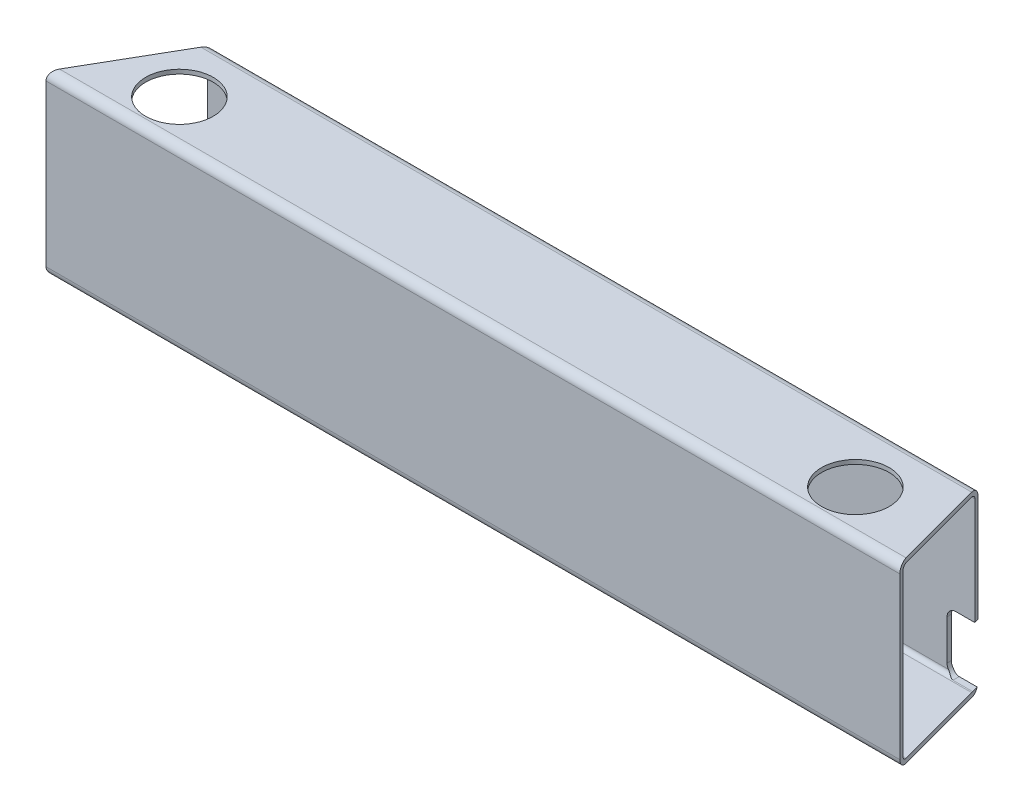
ISO-10303-21;
HEADER;
FILE_DESCRIPTION(('STEP AP214'),'2;1');
FILE_NAME('part.step','',(''),(''),'','','');
FILE_SCHEMA(('AUTOMOTIVE_DESIGN { 1 0 10303 214 1 1 1 1 }'));
ENDSEC;
DATA;
#1=APPLICATION_CONTEXT('core data for automotive mechanical design processes');
#2=APPLICATION_PROTOCOL_DEFINITION('international standard','automotive_design',2000,#1);
#3=PRODUCT_CONTEXT('',#1,'mechanical');
#4=PRODUCT('Part','Part','',(#3));
#5=PRODUCT_RELATED_PRODUCT_CATEGORY('part','',(#4));
#6=PRODUCT_DEFINITION_FORMATION('','',#4);
#7=PRODUCT_DEFINITION_CONTEXT('part definition',#1,'design');
#8=PRODUCT_DEFINITION('design','',#6,#7);
#9=PRODUCT_DEFINITION_SHAPE('','',#8);
#10=(LENGTH_UNIT() NAMED_UNIT(*) SI_UNIT(.MILLI.,.METRE.));
#11=(NAMED_UNIT(*) PLANE_ANGLE_UNIT() SI_UNIT($,.RADIAN.));
#12=(NAMED_UNIT(*) SI_UNIT($,.STERADIAN.) SOLID_ANGLE_UNIT());
#13=UNCERTAINTY_MEASURE_WITH_UNIT(LENGTH_MEASURE(1.E-05),#10,'distance_accuracy_value','');
#14=(GEOMETRIC_REPRESENTATION_CONTEXT(3) GLOBAL_UNCERTAINTY_ASSIGNED_CONTEXT((#13)) GLOBAL_UNIT_ASSIGNED_CONTEXT((#10,
#11,#12)) REPRESENTATION_CONTEXT('',''));
#15=CARTESIAN_POINT('',(0.,0.,0.));
#16=DIRECTION('',(0.,0.,1.));
#17=DIRECTION('',(1.,0.,0.));
#18=AXIS2_PLACEMENT_3D('',#15,#16,#17);
#19=CARTESIAN_POINT('',(63.5,0.,-31.75));
#20=DIRECTION('',(0.,1.,0.));
#21=DIRECTION('',(0.,0.,1.));
#22=AXIS2_PLACEMENT_3D('',#19,#20,#21);
#23=CYLINDRICAL_SURFACE('',#22,24.13);
#24=CARTESIAN_POINT('',(63.5,-123.952,-31.75));
#25=DIRECTION('',(0.,1.,0.));
#26=DIRECTION('',(0.,0.,1.));
#27=AXIS2_PLACEMENT_3D('',#24,#25,#26);
#28=CIRCLE('',#27,24.13);
#29=CARTESIAN_POINT('',(63.5,-123.952,-7.62));
#30=VERTEX_POINT('',#29);
#31=EDGE_CURVE('E265',#30,#30,#28,.F.);
#32=ORIENTED_EDGE('',*,*,#31,.F.);
#33=EDGE_LOOP('',(#32));
#34=FACE_BOUND('',#33,.T.);
#35=CARTESIAN_POINT('',(63.5,-127.,-31.75));
#36=DIRECTION('',(0.,1.,0.));
#37=DIRECTION('',(0.,0.,1.));
#38=AXIS2_PLACEMENT_3D('',#35,#36,#37);
#39=CIRCLE('',#38,24.13);
#40=CARTESIAN_POINT('',(63.5,-127.,-7.62));
#41=VERTEX_POINT('',#40);
#42=EDGE_CURVE('E20',#41,#41,#39,.T.);
#43=ORIENTED_EDGE('',*,*,#42,.F.);
#44=EDGE_LOOP('',(#43));
#45=FACE_BOUND('',#44,.T.);
#46=ADVANCED_FACE('F17',(#34,#45),#23,.F.);
#47=CARTESIAN_POINT('',(546.1,0.,-31.75));
#48=DIRECTION('',(0.,1.,0.));
#49=DIRECTION('',(0.,0.,1.));
#50=AXIS2_PLACEMENT_3D('',#47,#48,#49);
#51=CYLINDRICAL_SURFACE('',#50,24.13);
#52=CARTESIAN_POINT('',(546.1,-123.952,-31.75));
#53=DIRECTION('',(0.,1.,0.));
#54=DIRECTION('',(0.,0.,1.));
#55=AXIS2_PLACEMENT_3D('',#52,#53,#54);
#56=CIRCLE('',#55,24.13);
#57=CARTESIAN_POINT('',(546.1,-123.952,-7.62));
#58=VERTEX_POINT('',#57);
#59=EDGE_CURVE('E374',#58,#58,#56,.F.);
#60=ORIENTED_EDGE('',*,*,#59,.F.);
#61=EDGE_LOOP('',(#60));
#62=FACE_BOUND('',#61,.T.);
#63=CARTESIAN_POINT('',(546.1,-127.,-31.75));
#64=DIRECTION('',(0.,1.,0.));
#65=DIRECTION('',(0.,0.,1.));
#66=AXIS2_PLACEMENT_3D('',#63,#64,#65);
#67=CIRCLE('',#66,24.13);
#68=CARTESIAN_POINT('',(546.1,-127.,-7.62));
#69=VERTEX_POINT('',#68);
#70=EDGE_CURVE('E168',#69,#69,#67,.T.);
#71=ORIENTED_EDGE('',*,*,#70,.F.);
#72=EDGE_LOOP('',(#71));
#73=FACE_BOUND('',#72,.T.);
#74=ADVANCED_FACE('F571',(#62,#73),#51,.F.);
#75=CARTESIAN_POINT('',(63.5,0.,-31.75));
#76=DIRECTION('',(0.,1.,0.));
#77=DIRECTION('',(0.,0.,1.));
#78=AXIS2_PLACEMENT_3D('',#75,#76,#77);
#79=CYLINDRICAL_SURFACE('',#78,24.13);
#80=CARTESIAN_POINT('',(63.5,-3.048,-31.75));
#81=DIRECTION('',(0.,1.,0.));
#82=DIRECTION('',(0.,0.,1.));
#83=AXIS2_PLACEMENT_3D('',#80,#81,#82);
#84=CIRCLE('',#83,24.13);
#85=CARTESIAN_POINT('',(63.5,-3.048,-7.62));
#86=VERTEX_POINT('',#85);
#87=EDGE_CURVE('E371',#86,#86,#84,.T.);
#88=ORIENTED_EDGE('',*,*,#87,.F.);
#89=EDGE_LOOP('',(#88));
#90=FACE_BOUND('',#89,.T.);
#91=CARTESIAN_POINT('',(63.5,0.,-31.75));
#92=DIRECTION('',(0.,1.,0.));
#93=DIRECTION('',(0.,0.,1.));
#94=AXIS2_PLACEMENT_3D('',#91,#92,#93);
#95=CIRCLE('',#94,24.13);
#96=CARTESIAN_POINT('',(63.5,0.,-7.62));
#97=VERTEX_POINT('',#96);
#98=EDGE_CURVE('E270',#97,#97,#95,.F.);
#99=ORIENTED_EDGE('',*,*,#98,.F.);
#100=EDGE_LOOP('',(#99));
#101=FACE_BOUND('',#100,.T.);
#102=ADVANCED_FACE('F561',(#90,#101),#79,.F.);
#103=CARTESIAN_POINT('',(546.1,0.,-31.75));
#104=DIRECTION('',(0.,1.,0.));
#105=DIRECTION('',(0.,0.,1.));
#106=AXIS2_PLACEMENT_3D('',#103,#104,#105);
#107=CYLINDRICAL_SURFACE('',#106,24.13);
#108=CARTESIAN_POINT('',(546.1,-3.048,-31.75));
#109=DIRECTION('',(0.,1.,0.));
#110=DIRECTION('',(0.,0.,1.));
#111=AXIS2_PLACEMENT_3D('',#108,#109,#110);
#112=CIRCLE('',#111,24.13);
#113=CARTESIAN_POINT('',(546.1,-3.048,-7.62));
#114=VERTEX_POINT('',#113);
#115=EDGE_CURVE('E367',#114,#114,#112,.T.);
#116=ORIENTED_EDGE('',*,*,#115,.F.);
#117=EDGE_LOOP('',(#116));
#118=FACE_BOUND('',#117,.T.);
#119=CARTESIAN_POINT('',(546.1,0.,-31.75));
#120=DIRECTION('',(0.,1.,0.));
#121=DIRECTION('',(0.,0.,1.));
#122=AXIS2_PLACEMENT_3D('',#119,#120,#121);
#123=CIRCLE('',#122,24.13);
#124=CARTESIAN_POINT('',(546.1,0.,-7.62));
#125=VERTEX_POINT('',#124);
#126=EDGE_CURVE('E267',#125,#125,#123,.F.);
#127=ORIENTED_EDGE('',*,*,#126,.F.);
#128=EDGE_LOOP('',(#127));
#129=FACE_BOUND('',#128,.T.);
#130=ADVANCED_FACE('F552',(#118,#129),#107,.F.);
#131=CARTESIAN_POINT('',(570.132271536834,-117.475,-76.2));
#132=DIRECTION('',(-1.,0.,0.));
#133=DIRECTION('',(0.,0.,1.));
#134=AXIS2_PLACEMENT_3D('',#131,#132,#133);
#135=PLANE('',#134);
#136=DIRECTION('',(0.,1.,0.));
#137=VECTOR('',#136,1.);
#138=CARTESIAN_POINT('',(570.132271536834,-6.096,-73.152));
#139=LINE('',#138,#137);
#140=CARTESIAN_POINT('',(570.132271536834,-117.475,-73.152));
#141=VERTEX_POINT('',#140);
#142=CARTESIAN_POINT('',(570.132271536834,-88.9,-73.152));
#143=VERTEX_POINT('',#142);
#144=EDGE_CURVE('E366',#141,#143,#139,.T.);
#145=ORIENTED_EDGE('',*,*,#144,.F.);
#146=DIRECTION('',(0.,0.,-1.));
#147=VECTOR('',#146,1.);
#148=CARTESIAN_POINT('',(570.132271536834,-117.475,-76.2));
#149=LINE('',#148,#147);
#150=CARTESIAN_POINT('',(570.132271536834,-117.475,-76.2));
#151=VERTEX_POINT('',#150);
#152=EDGE_CURVE('E150',#141,#151,#149,.T.);
#153=ORIENTED_EDGE('',*,*,#152,.T.);
#154=DIRECTION('',(0.,1.,0.));
#155=VECTOR('',#154,1.);
#156=CARTESIAN_POINT('',(570.132271536834,-120.904,-76.2));
#157=LINE('',#156,#155);
#158=CARTESIAN_POINT('',(570.132271536834,-88.9,-76.2));
#159=VERTEX_POINT('',#158);
#160=EDGE_CURVE('E275',#159,#151,#157,.F.);
#161=ORIENTED_EDGE('',*,*,#160,.F.);
#162=DIRECTION('',(0.,0.,-1.));
#163=VECTOR('',#162,1.);
#164=CARTESIAN_POINT('',(570.132271536834,-88.9,-76.2));
#165=LINE('',#164,#163);
#166=EDGE_CURVE('E299',#159,#143,#165,.F.);
#167=ORIENTED_EDGE('',*,*,#166,.T.);
#168=EDGE_LOOP('',(#145,#153,#161,#167));
#169=FACE_BOUND('',#168,.T.);
#170=ADVANCED_FACE('F497',(#169),#135,.F.);
#171=CARTESIAN_POINT('',(576.482271536834,-88.9,-76.2));
#172=DIRECTION('',(0.,0.,-1.));
#173=DIRECTION('',(-1.,0.,0.));
#174=AXIS2_PLACEMENT_3D('',#171,#172,#173);
#175=CYLINDRICAL_SURFACE('',#174,6.35);
#176=CARTESIAN_POINT('',(576.482271536834,-88.9,-73.152));
#177=DIRECTION('',(0.,0.,-1.));
#178=DIRECTION('',(-1.,0.,0.));
#179=AXIS2_PLACEMENT_3D('',#176,#177,#178);
#180=CIRCLE('',#179,6.35);
#181=CARTESIAN_POINT('',(576.482271536834,-82.55,-73.152));
#182=VERTEX_POINT('',#181);
#183=EDGE_CURVE('E362',#143,#182,#180,.T.);
#184=ORIENTED_EDGE('',*,*,#183,.F.);
#185=ORIENTED_EDGE('',*,*,#166,.F.);
#186=CARTESIAN_POINT('',(576.482271536834,-88.9,-76.2));
#187=DIRECTION('',(0.,0.,-1.));
#188=DIRECTION('',(-1.,0.,0.));
#189=AXIS2_PLACEMENT_3D('',#186,#187,#188);
#190=CIRCLE('',#189,6.35);
#191=CARTESIAN_POINT('',(576.482271536834,-82.55,-76.2));
#192=VERTEX_POINT('',#191);
#193=EDGE_CURVE('E176',#192,#159,#190,.F.);
#194=ORIENTED_EDGE('',*,*,#193,.F.);
#195=DIRECTION('',(0.,0.,1.));
#196=VECTOR('',#195,1.);
#197=CARTESIAN_POINT('',(576.482271536834,-82.55,-76.2));
#198=LINE('',#197,#196);
#199=EDGE_CURVE('E149',#192,#182,#198,.T.);
#200=ORIENTED_EDGE('',*,*,#199,.T.);
#201=EDGE_LOOP('',(#184,#185,#194,#200));
#202=FACE_BOUND('',#201,.T.);
#203=ADVANCED_FACE('F199',(#202),#175,.F.);
#204=CARTESIAN_POINT('',(576.482271536834,-117.475,-76.2));
#205=DIRECTION('',(0.,0.,-1.));
#206=DIRECTION('',(-1.,0.,0.));
#207=AXIS2_PLACEMENT_3D('',#204,#205,#206);
#208=CYLINDRICAL_SURFACE('',#207,6.35);
#209=ORIENTED_EDGE('',*,*,#152,.F.);
#210=CARTESIAN_POINT('',(576.482271536834,-117.475,-73.152));
#211=DIRECTION('',(0.,0.,-1.));
#212=DIRECTION('',(-1.,0.,0.));
#213=AXIS2_PLACEMENT_3D('',#210,#211,#212);
#214=CIRCLE('',#213,6.35);
#215=CARTESIAN_POINT('',(571.13769868204,-120.903999999971,-73.152));
#216=VERTEX_POINT('',#215);
#217=EDGE_CURVE('E357',#216,#141,#214,.T.);
#218=ORIENTED_EDGE('',*,*,#217,.F.);
#219=CARTESIAN_POINT('',(571.137698682022,-120.903999999942,-73.152));
#220=CARTESIAN_POINT('',(571.208653888073,-121.014657092336,-73.1519958651403));
#221=CARTESIAN_POINT('',(571.283026270926,-121.12295772783,-73.145978259839));
#222=CARTESIAN_POINT('',(571.437581092071,-121.33382465817,-73.123399265219));
#223=CARTESIAN_POINT('',(571.517749917778,-121.436403446459,-73.1068619109767));
#224=CARTESIAN_POINT('',(571.682008220305,-121.633878408931,-73.0650179072658));
#225=CARTESIAN_POINT('',(571.766024265583,-121.728864207435,-73.0398414844985));
#226=CARTESIAN_POINT('',(571.938368942122,-121.912489223484,-72.9819379408593));
#227=CARTESIAN_POINT('',(572.026700427849,-122.001124141943,-72.9492057674007));
#228=CARTESIAN_POINT('',(572.231414776507,-122.194915113941,-72.8676366480196));
#229=CARTESIAN_POINT('',(572.348923299269,-122.298056286764,-72.8168383013525));
#230=CARTESIAN_POINT('',(572.588812327703,-122.493709927749,-72.7070205359819));
#231=CARTESIAN_POINT('',(572.711193854511,-122.586220152248,-72.6479993876496));
#232=CARTESIAN_POINT('',(572.961495947899,-122.761802691016,-72.522807859894));
#233=CARTESIAN_POINT('',(573.089464468219,-122.844752351779,-72.4565621296623));
#234=CARTESIAN_POINT('',(573.348962977242,-123.000192109509,-72.3191829844994));
#235=CARTESIAN_POINT('',(573.480491686998,-123.072685904891,-72.2480513110158));
#236=CARTESIAN_POINT('',(573.785324327221,-123.227044413727,-72.0814042138575));
#237=CARTESIAN_POINT('',(573.959717596788,-123.305564192278,-71.9847820397144));
#238=CARTESIAN_POINT('',(574.314253476113,-123.446492183462,-71.7893814923592));
#239=CARTESIAN_POINT('',(574.494407246292,-123.508866687309,-71.6905990675455));
#240=CARTESIAN_POINT('',(574.767732795365,-123.589869040889,-71.5460144516401));
#241=CARTESIAN_POINT('',(574.858426999393,-123.614588101186,-71.4988759713409));
#242=CARTESIAN_POINT('',(575.041725271297,-123.660163782859,-71.4065005027832));
#243=CARTESIAN_POINT('',(575.134328864399,-123.68102135183,-71.3612630501308));
#244=CARTESIAN_POINT('',(575.321618448017,-123.718755649125,-71.2743378244688));
#245=CARTESIAN_POINT('',(575.416296675764,-123.735645119006,-71.2326389723888));
#246=CARTESIAN_POINT('',(575.608577832337,-123.76535826243,-71.1550235058921));
#247=CARTESIAN_POINT('',(575.706176994021,-123.77818694514,-71.1190997947215));
#248=CARTESIAN_POINT('',(575.859700250299,-123.794641678185,-71.0708637573932));
#249=CARTESIAN_POINT('',(575.914412605435,-123.799800719976,-71.055239284402));
#250=CARTESIAN_POINT('',(576.024822343718,-123.808743558447,-71.0275679263626));
#251=CARTESIAN_POINT('',(576.08051901312,-123.812528311941,-71.0155185533119));
#252=CARTESIAN_POINT('',(576.193535398544,-123.81868715446,-70.9956391956563));
#253=CARTESIAN_POINT('',(576.250866870767,-123.821041562307,-70.9878682108877));
#254=CARTESIAN_POINT('',(576.366205634296,-123.824204177821,-70.9773392444036));
#255=CARTESIAN_POINT('',(576.424214488584,-123.825007476577,-70.9745971794587));
#256=CARTESIAN_POINT('',(576.482271536834,-123.825,-70.9746681342509));
#257=B_SPLINE_CURVE_WITH_KNOTS('',3,(#219,#220,#221,#222,#223,#224,#225,#226,#227,#228,#229,
#230,#231,#232,#233,#234,#235,#236,#237,#238,#239,#240,#241,#242,#243,#244,#245,#246,#247,#248,
#249,#250,#251,#252,#253,#254,#255,#256),.UNSPECIFIED.,.F.,.F.,(4,2,2,2,2,2,2,2,2,2,2,2,2,2,2,2,
2,2,4),(0.,0.393954233361409,0.787011593898648,1.17438683815423,1.56202187739938,
2.05449256514312,2.54706699868426,3.04538613255923,3.54352856804493,4.18560929528554,
4.82901996545668,5.14442158884071,5.45974571082867,5.77404305028703,6.08795116493568,
6.2592416152802,6.43041257915382,6.60388840317165,6.77791234510042),.UNSPECIFIED.);
#258=CARTESIAN_POINT('',(576.482271536834,-123.825,-70.9746681342508));
#259=VERTEX_POINT('',#258);
#260=EDGE_CURVE('E146',#216,#259,#257,.T.);
#261=ORIENTED_EDGE('',*,*,#260,.T.);
#262=DIRECTION('',(0.,0.,-1.));
#263=VECTOR('',#262,1.);
#264=CARTESIAN_POINT('',(576.482271536834,-123.825,-76.2));
#265=LINE('',#264,#263);
#266=CARTESIAN_POINT('',(576.482271536834,-123.825000000002,-75.4546051059658));
#267=VERTEX_POINT('',#266);
#268=EDGE_CURVE('E141',#259,#267,#265,.T.);
#269=ORIENTED_EDGE('',*,*,#268,.T.);
#270=CARTESIAN_POINT('',(571.137698681995,-120.90399999996,-76.199999999968));
#271=CARTESIAN_POINT('',(571.229548470559,-121.047218320689,-76.2000141654088));
#272=CARTESIAN_POINT('',(571.327147979681,-121.186623333409,-76.1949548697989));
#273=CARTESIAN_POINT('',(571.532774311161,-121.456661995913,-76.1763983930361));
#274=CARTESIAN_POINT('',(571.640787783037,-121.58730652135,-76.1629118968739));
#275=CARTESIAN_POINT('',(571.865859496941,-121.838435773336,-76.1292833197039));
#276=CARTESIAN_POINT('',(571.982871285211,-121.958966742242,-76.1091738663658));
#277=CARTESIAN_POINT('',(572.225572283501,-122.189985451436,-76.0639758122435));
#278=CARTESIAN_POINT('',(572.351264179746,-122.300470057959,-76.0388856655453));
#279=CARTESIAN_POINT('',(572.609966090187,-122.510411484481,-75.9855252384734));
#280=CARTESIAN_POINT('',(572.742941255954,-122.609914944599,-75.957269523341));
#281=CARTESIAN_POINT('',(573.015956786792,-122.798033213789,-75.8991311075693));
#282=CARTESIAN_POINT('',(573.155996724555,-122.886648680303,-75.8692485053227));
#283=CARTESIAN_POINT('',(573.586418437015,-123.135952850148,-75.7794622469485));
#284=CARTESIAN_POINT('',(573.886860020719,-123.279903186667,-75.7194756338277));
#285=CARTESIAN_POINT('',(574.349627762606,-123.458398652998,-75.6393762726864));
#286=CARTESIAN_POINT('',(574.504351787288,-123.511322015341,-75.6145172310321));
#287=CARTESIAN_POINT('',(574.817986132874,-123.605203440564,-75.5691112922593));
#288=CARTESIAN_POINT('',(574.976894268534,-123.646167619369,-75.5485621925556));
#289=CARTESIAN_POINT('',(575.297602492867,-123.715667495566,-75.5129984910171));
#290=CARTESIAN_POINT('',(575.459394736727,-123.744232747921,-75.4979707413877));
#291=CARTESIAN_POINT('',(575.785103786285,-123.788749680078,-75.4742960802758));
#292=CARTESIAN_POINT('',(575.949019144764,-123.804709535309,-75.4656450333261));
#293=CARTESIAN_POINT('',(576.174780796943,-123.817849647522,-75.4585033176622));
#294=CARTESIAN_POINT('',(576.236259239799,-123.82053131451,-75.4570425763327));
#295=CARTESIAN_POINT('',(576.359246450461,-123.824105797844,-75.455093597044));
#296=CARTESIAN_POINT('',(576.420755177753,-123.824999689763,-75.4546047743546));
#297=CARTESIAN_POINT('',(576.482271536834,-123.825,-75.454605105967));
#298=B_SPLINE_CURVE_WITH_KNOTS('',3,(#270,#271,#272,#273,#274,#275,#276,#277,#278,#279,#280,
#281,#282,#283,#284,#285,#286,#287,#288,#289,#290,#291,#292,#293,#294,#295,#296,#297),
.UNSPECIFIED.,.F.,.F.,(4,2,2,2,2,2,2,2,2,2,2,2,2,4),(0.,0.510056394583429,1.01946738859741,
1.52640542381374,2.03350104981312,2.53835249907291,3.04317344915919,4.05375545154912,
4.54956480614795,5.04512015785623,5.53948769343207,6.03353433527749,6.21817090721173,
6.40269636359293),.UNSPECIFIED.);
#299=CARTESIAN_POINT('',(571.13769868204,-120.903999999971,-76.2));
#300=VERTEX_POINT('',#299);
#301=EDGE_CURVE('E138',#300,#267,#298,.T.);
#302=ORIENTED_EDGE('',*,*,#301,.F.);
#303=CARTESIAN_POINT('',(576.482271536834,-117.475,-76.2));
#304=DIRECTION('',(0.,0.,-1.));
#305=DIRECTION('',(-1.,0.,0.));
#306=AXIS2_PLACEMENT_3D('',#303,#304,#305);
#307=CIRCLE('',#306,6.35);
#308=EDGE_CURVE('E273',#151,#300,#307,.F.);
#309=ORIENTED_EDGE('',*,*,#308,.F.);
#310=EDGE_LOOP('',(#209,#218,#261,#269,#302,#309));
#311=FACE_BOUND('',#310,.T.);
#312=ADVANCED_FACE('F144',(#311),#208,.F.);
#313=CARTESIAN_POINT('',(592.357271536834,-123.825,-76.2));
#314=DIRECTION('',(0.,-1.,0.));
#315=DIRECTION('',(0.,0.,-1.));
#316=AXIS2_PLACEMENT_3D('',#313,#314,#315);
#317=PLANE('',#316);
#318=DIRECTION('',(1.,0.,0.));
#319=VECTOR('',#318,1.);
#320=CARTESIAN_POINT('',(0.,-123.825,-70.9746681342508));
#321=LINE('',#320,#319);
#322=CARTESIAN_POINT('',(590.582394990446,-123.825,-70.9746681342508));
#323=VERTEX_POINT('',#322);
#324=EDGE_CURVE('E264',#259,#323,#321,.T.);
#325=ORIENTED_EDGE('',*,*,#324,.T.);
#326=DIRECTION('',(0.258819045102493,0.,0.965925826289076));
#327=VECTOR('',#326,1.);
#328=CARTESIAN_POINT('',(589.182271536834,-123.825,-76.2));
#329=LINE('',#328,#327);
#330=CARTESIAN_POINT('',(589.381999496733,-123.825000000002,-75.4546051059658));
#331=VERTEX_POINT('',#330);
#332=EDGE_CURVE('E156',#323,#331,#329,.F.);
#333=ORIENTED_EDGE('',*,*,#332,.T.);
#334=DIRECTION('',(1.,0.,0.));
#335=VECTOR('',#334,1.);
#336=CARTESIAN_POINT('',(0.,-123.825000000004,-75.4546051059646));
#337=LINE('',#336,#335);
#338=EDGE_CURVE('E153',#267,#331,#337,.T.);
#339=ORIENTED_EDGE('',*,*,#338,.F.);
#340=ORIENTED_EDGE('',*,*,#268,.F.);
#341=EDGE_LOOP('',(#325,#333,#339,#340));
#342=FACE_BOUND('',#341,.T.);
#343=ADVANCED_FACE('F154',(#342),#317,.F.);
#344=CARTESIAN_POINT('',(576.482271536834,-82.55,-76.2));
#345=DIRECTION('',(0.,1.,0.));
#346=DIRECTION('',(0.,0.,1.));
#347=AXIS2_PLACEMENT_3D('',#344,#345,#346);
#348=PLANE('',#347);
#349=DIRECTION('',(1.,0.,0.));
#350=VECTOR('',#349,1.);
#351=CARTESIAN_POINT('',(0.,-82.55,-73.152));
#352=LINE('',#351,#350);
#353=CARTESIAN_POINT('',(589.998980675347,-82.55,-73.1520000000073));
#354=VERTEX_POINT('',#353);
#355=EDGE_CURVE('E365',#182,#354,#352,.T.);
#356=ORIENTED_EDGE('',*,*,#355,.F.);
#357=ORIENTED_EDGE('',*,*,#199,.F.);
#358=DIRECTION('',(-1.,0.,0.));
#359=VECTOR('',#358,1.);
#360=CARTESIAN_POINT('',(0.,-82.55,-76.2));
#361=LINE('',#360,#359);
#362=CARTESIAN_POINT('',(589.182271536834,-82.55,-76.2));
#363=VERTEX_POINT('',#362);
#364=EDGE_CURVE('E283',#363,#192,#361,.T.);
#365=ORIENTED_EDGE('',*,*,#364,.F.);
#366=DIRECTION('',(0.258819045102493,0.,0.965925826289076));
#367=VECTOR('',#366,1.);
#368=CARTESIAN_POINT('',(589.182271536834,-82.55,-76.2));
#369=LINE('',#368,#367);
#370=EDGE_CURVE('E291',#363,#354,#369,.T.);
#371=ORIENTED_EDGE('',*,*,#370,.T.);
#372=EDGE_LOOP('',(#356,#357,#365,#371));
#373=FACE_BOUND('',#372,.T.);
#374=ADVANCED_FACE('F190',(#373),#348,.F.);
#375=CARTESIAN_POINT('',(0.,-127.,-6.096));
#376=DIRECTION('',(0.,-1.,0.));
#377=DIRECTION('',(0.,0.,-1.));
#378=AXIS2_PLACEMENT_3D('',#375,#376,#377);
#379=PLANE('',#378);
#380=ORIENTED_EDGE('',*,*,#70,.T.);
#381=EDGE_LOOP('',(#380));
#382=FACE_BOUND('',#381,.T.);
#383=ORIENTED_EDGE('',*,*,#42,.T.);
#384=EDGE_LOOP('',(#383));
#385=FACE_BOUND('',#384,.T.);
#386=DIRECTION('',(1.,0.,0.));
#387=VECTOR('',#386,1.);
#388=CARTESIAN_POINT('',(0.,-127.,-6.096));
#389=LINE('',#388,#387);
#390=CARTESIAN_POINT('',(3.51952724098012,-127.,-6.096));
#391=VERTEX_POINT('',#390);
#392=CARTESIAN_POINT('',(607.966581723023,-127.,-6.096));
#393=VERTEX_POINT('',#392);
#394=EDGE_CURVE('E360',#391,#393,#389,.T.);
#395=ORIENTED_EDGE('',*,*,#394,.F.);
#396=DIRECTION('',(0.500000000000017,0.,-0.866025403784429));
#397=VECTOR('',#396,1.);
#398=CARTESIAN_POINT('',(0.,-127.,0.));
#399=LINE('',#398,#397);
#400=CARTESIAN_POINT('',(40.4745632712713,-127.,-70.104));
#401=VERTEX_POINT('',#400);
#402=EDGE_CURVE('E325',#391,#401,#399,.T.);
#403=ORIENTED_EDGE('',*,*,#402,.T.);
#404=DIRECTION('',(1.,0.,0.));
#405=VECTOR('',#404,1.);
#406=CARTESIAN_POINT('',(0.,-127.,-70.104));
#407=LINE('',#406,#405);
#408=CARTESIAN_POINT('',(590.815689813894,-127.,-70.104));
#409=VERTEX_POINT('',#408);
#410=EDGE_CURVE('E165',#409,#401,#407,.F.);
#411=ORIENTED_EDGE('',*,*,#410,.F.);
#412=DIRECTION('',(0.258819045102493,0.,0.965925826289076));
#413=VECTOR('',#412,1.);
#414=CARTESIAN_POINT('',(589.182271536834,-127.,-76.2));
#415=LINE('',#414,#413);
#416=EDGE_CURVE('E354',#409,#393,#415,.T.);
#417=ORIENTED_EDGE('',*,*,#416,.T.);
#418=EDGE_LOOP('',(#395,#403,#411,#417));
#419=FACE_BOUND('',#418,.T.);
#420=ADVANCED_FACE('F186',(#382,#385,#419),#379,.T.);
#421=CARTESIAN_POINT('',(0.,-120.904,-70.104));
#422=DIRECTION('',(1.,0.,0.));
#423=DIRECTION('',(0.,0.,-1.));
#424=AXIS2_PLACEMENT_3D('',#421,#422,#423);
#425=CYLINDRICAL_SURFACE('',#424,6.096);
#426=ORIENTED_EDGE('',*,*,#301,.T.);
#427=ORIENTED_EDGE('',*,*,#338,.T.);
#428=CARTESIAN_POINT('',(590.815689813894,-120.904,-70.104));
#429=DIRECTION('',(-0.965925826289076,0.,0.258819045102493));
#430=DIRECTION('',(0.258819045102493,0.,0.965925826289076));
#431=AXIS2_PLACEMENT_3D('',#428,#429,#430);
#432=ELLIPSE('',#431,6.31104359577982,6.096);
#433=EDGE_CURVE('E355',#331,#409,#432,.T.);
#434=ORIENTED_EDGE('',*,*,#433,.T.);
#435=ORIENTED_EDGE('',*,*,#410,.T.);
#436=CARTESIAN_POINT('',(40.4745632712713,-120.904,-70.104));
#437=DIRECTION('',(0.866025403784429,0.,0.500000000000017));
#438=DIRECTION('',(0.500000000000017,0.,-0.866025403784429));
#439=AXIS2_PLACEMENT_3D('',#436,#437,#438);
#440=ELLIPSE('',#439,7.03905448195999,6.096);
#441=CARTESIAN_POINT('',(43.9940905122516,-120.904,-76.2000000000001));
#442=VERTEX_POINT('',#441);
#443=EDGE_CURVE('E323',#401,#442,#440,.T.);
#444=ORIENTED_EDGE('',*,*,#443,.T.);
#445=DIRECTION('',(-1.,0.,0.));
#446=VECTOR('',#445,1.);
#447=CARTESIAN_POINT('',(0.,-120.904,-76.2));
#448=LINE('',#447,#446);
#449=EDGE_CURVE('E160',#300,#442,#448,.T.);
#450=ORIENTED_EDGE('',*,*,#449,.F.);
#451=EDGE_LOOP('',(#426,#427,#434,#435,#444,#450));
#452=FACE_BOUND('',#451,.T.);
#453=ADVANCED_FACE('F162',(#452),#425,.T.);
#454=CARTESIAN_POINT('',(0.,-120.904,-76.2));
#455=DIRECTION('',(0.,0.,-1.));
#456=DIRECTION('',(-1.,0.,0.));
#457=AXIS2_PLACEMENT_3D('',#454,#455,#456);
#458=PLANE('',#457);
#459=ORIENTED_EDGE('',*,*,#160,.T.);
#460=ORIENTED_EDGE('',*,*,#308,.T.);
#461=ORIENTED_EDGE('',*,*,#449,.T.);
#462=DIRECTION('',(0.,1.,0.));
#463=VECTOR('',#462,1.);
#464=CARTESIAN_POINT('',(43.9940905122517,0.,-76.2000000000005));
#465=LINE('',#464,#463);
#466=CARTESIAN_POINT('',(43.9940905122516,-6.096,-76.2000000000001));
#467=VERTEX_POINT('',#466);
#468=EDGE_CURVE('E322',#442,#467,#465,.T.);
#469=ORIENTED_EDGE('',*,*,#468,.T.);
#470=DIRECTION('',(1.,0.,0.));
#471=VECTOR('',#470,1.);
#472=CARTESIAN_POINT('',(0.,-6.096,-76.2));
#473=LINE('',#472,#471);
#474=CARTESIAN_POINT('',(589.182271536834,-6.096,-76.2));
#475=VERTEX_POINT('',#474);
#476=EDGE_CURVE('E274',#475,#467,#473,.F.);
#477=ORIENTED_EDGE('',*,*,#476,.F.);
#478=DIRECTION('',(0.,1.,0.));
#479=VECTOR('',#478,1.);
#480=CARTESIAN_POINT('',(589.182271536834,0.,-76.2));
#481=LINE('',#480,#479);
#482=EDGE_CURVE('E295',#475,#363,#481,.F.);
#483=ORIENTED_EDGE('',*,*,#482,.T.);
#484=ORIENTED_EDGE('',*,*,#364,.T.);
#485=ORIENTED_EDGE('',*,*,#193,.T.);
#486=EDGE_LOOP('',(#459,#460,#461,#469,#477,#483,#484,#485));
#487=FACE_BOUND('',#486,.T.);
#488=ADVANCED_FACE('F185',(#487),#458,.T.);
#489=CARTESIAN_POINT('',(0.,-6.096,-70.104));
#490=DIRECTION('',(1.,0.,0.));
#491=DIRECTION('',(0.,0.,-1.));
#492=AXIS2_PLACEMENT_3D('',#489,#490,#491);
#493=CYLINDRICAL_SURFACE('',#492,6.096);
#494=ORIENTED_EDGE('',*,*,#476,.T.);
#495=CARTESIAN_POINT('',(40.4745632712713,-6.096,-70.104));
#496=DIRECTION('',(0.866025403784429,0.,0.500000000000017));
#497=DIRECTION('',(0.500000000000017,0.,-0.866025403784429));
#498=AXIS2_PLACEMENT_3D('',#495,#496,#497);
#499=ELLIPSE('',#498,7.03905448195999,6.096);
#500=CARTESIAN_POINT('',(40.4745632712713,0.,-70.104));
#501=VERTEX_POINT('',#500);
#502=EDGE_CURVE('E320',#467,#501,#499,.T.);
#503=ORIENTED_EDGE('',*,*,#502,.T.);
#504=DIRECTION('',(1.,0.,0.));
#505=VECTOR('',#504,1.);
#506=CARTESIAN_POINT('',(0.,0.,-70.104));
#507=LINE('',#506,#505);
#508=CARTESIAN_POINT('',(590.815689813894,0.,-70.104));
#509=VERTEX_POINT('',#508);
#510=EDGE_CURVE('E272',#509,#501,#507,.F.);
#511=ORIENTED_EDGE('',*,*,#510,.F.);
#512=CARTESIAN_POINT('',(590.815689813894,-6.096,-70.104));
#513=DIRECTION('',(-0.965925826289076,0.,0.258819045102493));
#514=DIRECTION('',(0.258819045102493,0.,0.965925826289076));
#515=AXIS2_PLACEMENT_3D('',#512,#513,#514);
#516=ELLIPSE('',#515,6.31104359577982,6.096);
#517=EDGE_CURVE('E348',#509,#475,#516,.T.);
#518=ORIENTED_EDGE('',*,*,#517,.T.);
#519=EDGE_LOOP('',(#494,#503,#511,#518));
#520=FACE_BOUND('',#519,.T.);
#521=ADVANCED_FACE('F500',(#520),#493,.T.);
#522=CARTESIAN_POINT('',(0.,0.,-70.104));
#523=DIRECTION('',(0.,1.,0.));
#524=DIRECTION('',(0.,0.,1.));
#525=AXIS2_PLACEMENT_3D('',#522,#523,#524);
#526=PLANE('',#525);
#527=ORIENTED_EDGE('',*,*,#126,.T.);
#528=EDGE_LOOP('',(#527));
#529=FACE_BOUND('',#528,.T.);
#530=ORIENTED_EDGE('',*,*,#98,.T.);
#531=EDGE_LOOP('',(#530));
#532=FACE_BOUND('',#531,.T.);
#533=ORIENTED_EDGE('',*,*,#510,.T.);
#534=DIRECTION('',(0.500000000000017,0.,-0.866025403784429));
#535=VECTOR('',#534,1.);
#536=CARTESIAN_POINT('',(0.,0.,0.));
#537=LINE('',#536,#535);
#538=CARTESIAN_POINT('',(3.51952724098012,0.,-6.096));
#539=VERTEX_POINT('',#538);
#540=EDGE_CURVE('E319',#501,#539,#537,.F.);
#541=ORIENTED_EDGE('',*,*,#540,.T.);
#542=DIRECTION('',(1.,0.,0.));
#543=VECTOR('',#542,1.);
#544=CARTESIAN_POINT('',(0.,0.,-6.096));
#545=LINE('',#544,#543);
#546=CARTESIAN_POINT('',(607.966581723023,0.,-6.096));
#547=VERTEX_POINT('',#546);
#548=EDGE_CURVE('E329',#547,#539,#545,.F.);
#549=ORIENTED_EDGE('',*,*,#548,.F.);
#550=DIRECTION('',(0.258819045102493,0.,0.965925826289076));
#551=VECTOR('',#550,1.);
#552=CARTESIAN_POINT('',(589.182271536834,0.,-76.2));
#553=LINE('',#552,#551);
#554=EDGE_CURVE('E351',#547,#509,#553,.F.);
#555=ORIENTED_EDGE('',*,*,#554,.T.);
#556=EDGE_LOOP('',(#533,#541,#549,#555));
#557=FACE_BOUND('',#556,.T.);
#558=ADVANCED_FACE('F255',(#529,#532,#557),#526,.T.);
#559=CARTESIAN_POINT('',(0.,-120.904,-70.104));
#560=DIRECTION('',(1.,0.,0.));
#561=DIRECTION('',(0.,0.,-1.));
#562=AXIS2_PLACEMENT_3D('',#559,#560,#561);
#563=CYLINDRICAL_SURFACE('',#562,3.048);
#564=DIRECTION('',(1.,0.,0.));
#565=VECTOR('',#564,1.);
#566=CARTESIAN_POINT('',(0.,-120.904,-73.152));
#567=LINE('',#566,#565);
#568=CARTESIAN_POINT('',(42.2343268917608,-120.904,-73.1519999999994));
#569=VERTEX_POINT('',#568);
#570=EDGE_CURVE('E361',#569,#216,#567,.T.);
#571=ORIENTED_EDGE('',*,*,#570,.F.);
#572=CARTESIAN_POINT('',(40.4745632712713,-120.904,-70.104));
#573=DIRECTION('',(0.866025403784429,0.,0.500000000000017));
#574=DIRECTION('',(0.500000000000017,0.,-0.866025403784429));
#575=AXIS2_PLACEMENT_3D('',#572,#573,#574);
#576=ELLIPSE('',#575,3.51952724098,3.048);
#577=CARTESIAN_POINT('',(40.4745632712713,-123.952,-70.104));
#578=VERTEX_POINT('',#577);
#579=EDGE_CURVE('E315',#569,#578,#576,.F.);
#580=ORIENTED_EDGE('',*,*,#579,.T.);
#581=DIRECTION('',(1.,0.,0.));
#582=VECTOR('',#581,1.);
#583=CARTESIAN_POINT('',(0.,-123.952,-70.104));
#584=LINE('',#583,#582);
#585=CARTESIAN_POINT('',(590.815689813894,-123.952,-70.104));
#586=VERTEX_POINT('',#585);
#587=EDGE_CURVE('E263',#586,#578,#584,.F.);
#588=ORIENTED_EDGE('',*,*,#587,.F.);
#589=CARTESIAN_POINT('',(590.815689813894,-120.904,-70.104));
#590=DIRECTION('',(-0.965925826289076,0.,0.258819045102493));
#591=DIRECTION('',(0.258819045102493,0.,0.965925826289076));
#592=AXIS2_PLACEMENT_3D('',#589,#590,#591);
#593=ELLIPSE('',#592,3.15552179788991,3.048);
#594=EDGE_CURVE('E333',#586,#323,#593,.F.);
#595=ORIENTED_EDGE('',*,*,#594,.T.);
#596=ORIENTED_EDGE('',*,*,#324,.F.);
#597=ORIENTED_EDGE('',*,*,#260,.F.);
#598=EDGE_LOOP('',(#571,#580,#588,#595,#596,#597));
#599=FACE_BOUND('',#598,.T.);
#600=ADVANCED_FACE('F250',(#599),#563,.F.);
#601=CARTESIAN_POINT('',(0.,-123.952,-70.104));
#602=DIRECTION('',(0.,1.,0.));
#603=DIRECTION('',(0.,0.,1.));
#604=AXIS2_PLACEMENT_3D('',#601,#602,#603);
#605=PLANE('',#604);
#606=ORIENTED_EDGE('',*,*,#59,.T.);
#607=EDGE_LOOP('',(#606));
#608=FACE_BOUND('',#607,.T.);
#609=ORIENTED_EDGE('',*,*,#31,.T.);
#610=EDGE_LOOP('',(#609));
#611=FACE_BOUND('',#610,.T.);
#612=ORIENTED_EDGE('',*,*,#587,.T.);
#613=DIRECTION('',(0.500000000000017,0.,-0.866025403784429));
#614=VECTOR('',#613,1.);
#615=CARTESIAN_POINT('',(0.,-123.952,0.));
#616=LINE('',#615,#614);
#617=CARTESIAN_POINT('',(3.51952724098012,-123.952,-6.096));
#618=VERTEX_POINT('',#617);
#619=EDGE_CURVE('E314',#578,#618,#616,.F.);
#620=ORIENTED_EDGE('',*,*,#619,.T.);
#621=DIRECTION('',(1.,0.,0.));
#622=VECTOR('',#621,1.);
#623=CARTESIAN_POINT('',(0.,-123.952,-6.096));
#624=LINE('',#623,#622);
#625=CARTESIAN_POINT('',(607.966581723023,-123.952,-6.096));
#626=VERTEX_POINT('',#625);
#627=EDGE_CURVE('E376',#618,#626,#624,.T.);
#628=ORIENTED_EDGE('',*,*,#627,.T.);
#629=DIRECTION('',(0.258819045102493,0.,0.965925826289076));
#630=VECTOR('',#629,1.);
#631=CARTESIAN_POINT('',(589.182271536834,-123.952,-76.2));
#632=LINE('',#631,#630);
#633=EDGE_CURVE('E336',#626,#586,#632,.F.);
#634=ORIENTED_EDGE('',*,*,#633,.T.);
#635=EDGE_LOOP('',(#612,#620,#628,#634));
#636=FACE_BOUND('',#635,.T.);
#637=ADVANCED_FACE('F246',(#608,#611,#636),#605,.T.);
#638=CARTESIAN_POINT('',(0.,-120.904,-6.096));
#639=DIRECTION('',(1.,0.,0.));
#640=DIRECTION('',(0.,0.,-1.));
#641=AXIS2_PLACEMENT_3D('',#638,#639,#640);
#642=CYLINDRICAL_SURFACE('',#641,3.048);
#643=CARTESIAN_POINT('',(607.966581723023,-120.904,-6.096));
#644=DIRECTION('',(-0.965925826289076,0.,0.258819045102493));
#645=DIRECTION('',(0.258819045102493,0.,0.965925826289076));
#646=AXIS2_PLACEMENT_3D('',#643,#644,#645);
#647=ELLIPSE('',#646,3.15552179788991,3.048);
#648=CARTESIAN_POINT('',(608.783290861552,-120.904,-3.04800000000244));
#649=VERTEX_POINT('',#648);
#650=EDGE_CURVE('E337',#649,#626,#647,.F.);
#651=ORIENTED_EDGE('',*,*,#650,.T.);
#652=ORIENTED_EDGE('',*,*,#627,.F.);
#653=CARTESIAN_POINT('',(3.51952724098012,-120.904,-6.096));
#654=DIRECTION('',(0.866025403784429,0.,0.500000000000017));
#655=DIRECTION('',(0.500000000000017,0.,-0.866025403784429));
#656=AXIS2_PLACEMENT_3D('',#653,#654,#655);
#657=ELLIPSE('',#656,3.51952724098,3.048);
#658=CARTESIAN_POINT('',(1.75976362049006,-120.904,-3.048));
#659=VERTEX_POINT('',#658);
#660=EDGE_CURVE('E311',#618,#659,#657,.F.);
#661=ORIENTED_EDGE('',*,*,#660,.T.);
#662=DIRECTION('',(-1.,0.,0.));
#663=VECTOR('',#662,1.);
#664=CARTESIAN_POINT('',(0.,-120.904,-3.048));
#665=LINE('',#664,#663);
#666=EDGE_CURVE('E378',#649,#659,#665,.T.);
#667=ORIENTED_EDGE('',*,*,#666,.F.);
#668=EDGE_LOOP('',(#651,#652,#661,#667));
#669=FACE_BOUND('',#668,.T.);
#670=ADVANCED_FACE('F242',(#669),#642,.F.);
#671=CARTESIAN_POINT('',(0.,-120.904,-3.048));
#672=DIRECTION('',(0.,0.,-1.));
#673=DIRECTION('',(-1.,0.,0.));
#674=AXIS2_PLACEMENT_3D('',#671,#672,#673);
#675=PLANE('',#674);
#676=ORIENTED_EDGE('',*,*,#666,.T.);
#677=DIRECTION('',(0.,1.,0.));
#678=VECTOR('',#677,1.);
#679=CARTESIAN_POINT('',(1.75976362049007,0.,-3.04800000000002));
#680=LINE('',#679,#678);
#681=CARTESIAN_POINT('',(1.75976362049006,-6.096,-3.048));
#682=VERTEX_POINT('',#681);
#683=EDGE_CURVE('E310',#659,#682,#680,.T.);
#684=ORIENTED_EDGE('',*,*,#683,.T.);
#685=DIRECTION('',(1.,0.,0.));
#686=VECTOR('',#685,1.);
#687=CARTESIAN_POINT('',(0.,-6.096,-3.048));
#688=LINE('',#687,#686);
#689=CARTESIAN_POINT('',(608.783290861552,-6.096,-3.04800000000244));
#690=VERTEX_POINT('',#689);
#691=EDGE_CURVE('E449',#682,#690,#688,.T.);
#692=ORIENTED_EDGE('',*,*,#691,.T.);
#693=DIRECTION('',(0.,1.,0.));
#694=VECTOR('',#693,1.);
#695=CARTESIAN_POINT('',(608.783290861551,0.,-3.04800000000978));
#696=LINE('',#695,#694);
#697=EDGE_CURVE('E340',#690,#649,#696,.F.);
#698=ORIENTED_EDGE('',*,*,#697,.T.);
#699=EDGE_LOOP('',(#676,#684,#692,#698));
#700=FACE_BOUND('',#699,.T.);
#701=ADVANCED_FACE('F238',(#700),#675,.T.);
#702=CARTESIAN_POINT('',(0.,-6.096,-6.096));
#703=DIRECTION('',(1.,0.,0.));
#704=DIRECTION('',(0.,0.,-1.));
#705=AXIS2_PLACEMENT_3D('',#702,#703,#704);
#706=CYLINDRICAL_SURFACE('',#705,3.048);
#707=CARTESIAN_POINT('',(607.966581723023,-6.096,-6.096));
#708=DIRECTION('',(-0.965925826289076,0.,0.258819045102493));
#709=DIRECTION('',(0.258819045102493,0.,0.965925826289076));
#710=AXIS2_PLACEMENT_3D('',#707,#708,#709);
#711=ELLIPSE('',#710,3.15552179788991,3.048);
#712=CARTESIAN_POINT('',(607.966581723023,-3.048,-6.096));
#713=VERTEX_POINT('',#712);
#714=EDGE_CURVE('E341',#713,#690,#711,.F.);
#715=ORIENTED_EDGE('',*,*,#714,.T.);
#716=ORIENTED_EDGE('',*,*,#691,.F.);
#717=CARTESIAN_POINT('',(3.51952724098012,-6.096,-6.096));
#718=DIRECTION('',(0.866025403784429,0.,0.500000000000017));
#719=DIRECTION('',(0.500000000000017,0.,-0.866025403784429));
#720=AXIS2_PLACEMENT_3D('',#717,#718,#719);
#721=ELLIPSE('',#720,3.51952724098,3.048);
#722=CARTESIAN_POINT('',(3.51952724098012,-3.048,-6.096));
#723=VERTEX_POINT('',#722);
#724=EDGE_CURVE('E307',#682,#723,#721,.F.);
#725=ORIENTED_EDGE('',*,*,#724,.T.);
#726=DIRECTION('',(1.,0.,0.));
#727=VECTOR('',#726,1.);
#728=CARTESIAN_POINT('',(0.,-3.048,-6.096));
#729=LINE('',#728,#727);
#730=EDGE_CURVE('E373',#713,#723,#729,.F.);
#731=ORIENTED_EDGE('',*,*,#730,.F.);
#732=EDGE_LOOP('',(#715,#716,#725,#731));
#733=FACE_BOUND('',#732,.T.);
#734=ADVANCED_FACE('F234',(#733),#706,.F.);
#735=CARTESIAN_POINT('',(0.,-3.048,-6.096));
#736=DIRECTION('',(0.,-1.,0.));
#737=DIRECTION('',(0.,0.,-1.));
#738=AXIS2_PLACEMENT_3D('',#735,#736,#737);
#739=PLANE('',#738);
#740=ORIENTED_EDGE('',*,*,#115,.T.);
#741=EDGE_LOOP('',(#740));
#742=FACE_BOUND('',#741,.T.);
#743=ORIENTED_EDGE('',*,*,#87,.T.);
#744=EDGE_LOOP('',(#743));
#745=FACE_BOUND('',#744,.T.);
#746=ORIENTED_EDGE('',*,*,#730,.T.);
#747=DIRECTION('',(0.500000000000017,0.,-0.866025403784429));
#748=VECTOR('',#747,1.);
#749=CARTESIAN_POINT('',(0.,-3.048,0.));
#750=LINE('',#749,#748);
#751=CARTESIAN_POINT('',(40.4745632712713,-3.048,-70.104));
#752=VERTEX_POINT('',#751);
#753=EDGE_CURVE('E306',#723,#752,#750,.T.);
#754=ORIENTED_EDGE('',*,*,#753,.T.);
#755=DIRECTION('',(1.,0.,0.));
#756=VECTOR('',#755,1.);
#757=CARTESIAN_POINT('',(0.,-3.048,-70.104));
#758=LINE('',#757,#756);
#759=CARTESIAN_POINT('',(590.815689813894,-3.048,-70.104));
#760=VERTEX_POINT('',#759);
#761=EDGE_CURVE('E370',#752,#760,#758,.T.);
#762=ORIENTED_EDGE('',*,*,#761,.T.);
#763=DIRECTION('',(0.258819045102493,0.,0.965925826289076));
#764=VECTOR('',#763,1.);
#765=CARTESIAN_POINT('',(589.182271536834,-3.048,-76.2));
#766=LINE('',#765,#764);
#767=EDGE_CURVE('E344',#760,#713,#766,.T.);
#768=ORIENTED_EDGE('',*,*,#767,.T.);
#769=EDGE_LOOP('',(#746,#754,#762,#768));
#770=FACE_BOUND('',#769,.T.);
#771=ADVANCED_FACE('F230',(#742,#745,#770),#739,.T.);
#772=CARTESIAN_POINT('',(0.,-6.096,-70.104));
#773=DIRECTION('',(1.,0.,0.));
#774=DIRECTION('',(0.,0.,-1.));
#775=AXIS2_PLACEMENT_3D('',#772,#773,#774);
#776=CYLINDRICAL_SURFACE('',#775,3.048);
#777=CARTESIAN_POINT('',(590.815689813894,-6.096,-70.104));
#778=DIRECTION('',(-0.965925826289076,0.,0.258819045102493));
#779=DIRECTION('',(0.258819045102493,0.,0.965925826289076));
#780=AXIS2_PLACEMENT_3D('',#777,#778,#779);
#781=ELLIPSE('',#780,3.15552179788991,3.048);
#782=CARTESIAN_POINT('',(589.998980675363,-6.096,-73.1520000000027));
#783=VERTEX_POINT('',#782);
#784=EDGE_CURVE('E345',#783,#760,#781,.F.);
#785=ORIENTED_EDGE('',*,*,#784,.T.);
#786=ORIENTED_EDGE('',*,*,#761,.F.);
#787=CARTESIAN_POINT('',(40.4745632712713,-6.096,-70.104));
#788=DIRECTION('',(0.866025403784429,0.,0.500000000000017));
#789=DIRECTION('',(0.500000000000017,0.,-0.866025403784429));
#790=AXIS2_PLACEMENT_3D('',#787,#788,#789);
#791=ELLIPSE('',#790,3.51952724098,3.048);
#792=CARTESIAN_POINT('',(42.2343268917608,-6.096,-73.1519999999994));
#793=VERTEX_POINT('',#792);
#794=EDGE_CURVE('E302',#752,#793,#791,.F.);
#795=ORIENTED_EDGE('',*,*,#794,.T.);
#796=DIRECTION('',(1.,0.,0.));
#797=VECTOR('',#796,1.);
#798=CARTESIAN_POINT('',(0.,-6.096,-73.152));
#799=LINE('',#798,#797);
#800=EDGE_CURVE('E437',#783,#793,#799,.F.);
#801=ORIENTED_EDGE('',*,*,#800,.F.);
#802=EDGE_LOOP('',(#785,#786,#795,#801));
#803=FACE_BOUND('',#802,.T.);
#804=ADVANCED_FACE('F226',(#803),#776,.F.);
#805=CARTESIAN_POINT('',(0.,-6.096,-73.152));
#806=DIRECTION('',(0.,0.,1.));
#807=DIRECTION('',(1.,0.,0.));
#808=AXIS2_PLACEMENT_3D('',#805,#806,#807);
#809=PLANE('',#808);
#810=ORIENTED_EDGE('',*,*,#570,.T.);
#811=ORIENTED_EDGE('',*,*,#217,.T.);
#812=ORIENTED_EDGE('',*,*,#144,.T.);
#813=ORIENTED_EDGE('',*,*,#183,.T.);
#814=ORIENTED_EDGE('',*,*,#355,.T.);
#815=DIRECTION('',(0.,1.,0.));
#816=VECTOR('',#815,1.);
#817=CARTESIAN_POINT('',(589.998980675361,0.,-73.152000000011));
#818=LINE('',#817,#816);
#819=EDGE_CURVE('E294',#354,#783,#818,.T.);
#820=ORIENTED_EDGE('',*,*,#819,.T.);
#821=ORIENTED_EDGE('',*,*,#800,.T.);
#822=DIRECTION('',(0.,1.,0.));
#823=VECTOR('',#822,1.);
#824=CARTESIAN_POINT('',(42.2343268917601,0.,-73.1519999999978));
#825=LINE('',#824,#823);
#826=EDGE_CURVE('E305',#793,#569,#825,.F.);
#827=ORIENTED_EDGE('',*,*,#826,.T.);
#828=EDGE_LOOP('',(#810,#811,#812,#813,#814,#820,#821,#827));
#829=FACE_BOUND('',#828,.T.);
#830=ADVANCED_FACE('F222',(#829),#809,.T.);
#831=CARTESIAN_POINT('',(0.,-120.904,-6.096));
#832=DIRECTION('',(1.,0.,0.));
#833=DIRECTION('',(0.,0.,-1.));
#834=AXIS2_PLACEMENT_3D('',#831,#832,#833);
#835=CYLINDRICAL_SURFACE('',#834,6.096);
#836=DIRECTION('',(1.,0.,0.));
#837=VECTOR('',#836,1.);
#838=CARTESIAN_POINT('',(0.,-120.904,0.));
#839=LINE('',#838,#837);
#840=CARTESIAN_POINT('',(0.,-120.904,0.));
#841=VERTEX_POINT('',#840);
#842=CARTESIAN_POINT('',(609.600000000042,-120.904,0.));
#843=VERTEX_POINT('',#842);
#844=EDGE_CURVE('E411',#841,#843,#839,.T.);
#845=ORIENTED_EDGE('',*,*,#844,.F.);
#846=CARTESIAN_POINT('',(3.51952724098012,-120.904,-6.096));
#847=DIRECTION('',(0.866025403784429,0.,0.500000000000017));
#848=DIRECTION('',(0.500000000000017,0.,-0.866025403784429));
#849=AXIS2_PLACEMENT_3D('',#846,#847,#848);
#850=ELLIPSE('',#849,7.03905448195999,6.096);
#851=EDGE_CURVE('E326',#841,#391,#850,.T.);
#852=ORIENTED_EDGE('',*,*,#851,.T.);
#853=ORIENTED_EDGE('',*,*,#394,.T.);
#854=CARTESIAN_POINT('',(607.966581723023,-120.904,-6.096));
#855=DIRECTION('',(-0.965925826289076,0.,0.258819045102493));
#856=DIRECTION('',(0.258819045102493,0.,0.965925826289076));
#857=AXIS2_PLACEMENT_3D('',#854,#855,#856);
#858=ELLIPSE('',#857,6.31104359577982,6.096);
#859=EDGE_CURVE('E352',#393,#843,#858,.T.);
#860=ORIENTED_EDGE('',*,*,#859,.T.);
#861=EDGE_LOOP('',(#845,#852,#853,#860));
#862=FACE_BOUND('',#861,.T.);
#863=ADVANCED_FACE('F218',(#862),#835,.T.);
#864=CARTESIAN_POINT('',(589.182271536834,0.,-76.2));
#865=DIRECTION('',(-0.965925826289076,0.,0.258819045102493));
#866=DIRECTION('',(0.258819045102493,0.,0.965925826289076));
#867=AXIS2_PLACEMENT_3D('',#864,#865,#866);
#868=PLANE('',#867);
#869=ORIENTED_EDGE('',*,*,#633,.F.);
#870=ORIENTED_EDGE('',*,*,#650,.F.);
#871=ORIENTED_EDGE('',*,*,#697,.F.);
#872=ORIENTED_EDGE('',*,*,#714,.F.);
#873=ORIENTED_EDGE('',*,*,#767,.F.);
#874=ORIENTED_EDGE('',*,*,#784,.F.);
#875=ORIENTED_EDGE('',*,*,#819,.F.);
#876=ORIENTED_EDGE('',*,*,#370,.F.);
#877=ORIENTED_EDGE('',*,*,#482,.F.);
#878=ORIENTED_EDGE('',*,*,#517,.F.);
#879=ORIENTED_EDGE('',*,*,#554,.F.);
#880=CARTESIAN_POINT('',(607.966581723023,-6.096,-6.096));
#881=DIRECTION('',(-0.965925826289076,0.,0.258819045102493));
#882=DIRECTION('',(0.258819045102493,0.,0.965925826289076));
#883=AXIS2_PLACEMENT_3D('',#880,#881,#882);
#884=ELLIPSE('',#883,6.31104359577982,6.096);
#885=CARTESIAN_POINT('',(609.600000000042,-6.096,0.));
#886=VERTEX_POINT('',#885);
#887=EDGE_CURVE('E330',#886,#547,#884,.T.);
#888=ORIENTED_EDGE('',*,*,#887,.F.);
#889=DIRECTION('',(0.,1.,0.));
#890=VECTOR('',#889,1.);
#891=CARTESIAN_POINT('',(609.6,-6.096,0.));
#892=LINE('',#891,#890);
#893=EDGE_CURVE('E409',#843,#886,#892,.T.);
#894=ORIENTED_EDGE('',*,*,#893,.F.);
#895=ORIENTED_EDGE('',*,*,#859,.F.);
#896=ORIENTED_EDGE('',*,*,#416,.F.);
#897=ORIENTED_EDGE('',*,*,#433,.F.);
#898=ORIENTED_EDGE('',*,*,#332,.F.);
#899=ORIENTED_EDGE('',*,*,#594,.F.);
#900=EDGE_LOOP('',(#869,#870,#871,#872,#873,#874,#875,#876,#877,#878,#879,#888,#894,#895,#896,
#897,#898,#899));
#901=FACE_BOUND('',#900,.T.);
#902=ADVANCED_FACE('F215',(#901),#868,.F.);
#903=CARTESIAN_POINT('',(0.,-6.096,-6.096));
#904=DIRECTION('',(1.,0.,0.));
#905=DIRECTION('',(0.,0.,-1.));
#906=AXIS2_PLACEMENT_3D('',#903,#904,#905);
#907=CYLINDRICAL_SURFACE('',#906,6.096);
#908=ORIENTED_EDGE('',*,*,#548,.T.);
#909=CARTESIAN_POINT('',(3.51952724098012,-6.096,-6.096));
#910=DIRECTION('',(0.866025403784429,0.,0.500000000000017));
#911=DIRECTION('',(0.500000000000017,0.,-0.866025403784429));
#912=AXIS2_PLACEMENT_3D('',#909,#910,#911);
#913=ELLIPSE('',#912,7.03905448195999,6.096);
#914=CARTESIAN_POINT('',(0.,-6.096,0.));
#915=VERTEX_POINT('',#914);
#916=EDGE_CURVE('E35',#539,#915,#913,.T.);
#917=ORIENTED_EDGE('',*,*,#916,.T.);
#918=DIRECTION('',(1.,0.,0.));
#919=VECTOR('',#918,1.);
#920=CARTESIAN_POINT('',(0.,-6.096,0.));
#921=LINE('',#920,#919);
#922=EDGE_CURVE('E26',#886,#915,#921,.F.);
#923=ORIENTED_EDGE('',*,*,#922,.F.);
#924=ORIENTED_EDGE('',*,*,#887,.T.);
#925=EDGE_LOOP('',(#908,#917,#923,#924));
#926=FACE_BOUND('',#925,.T.);
#927=ADVANCED_FACE('F208',(#926),#907,.T.);
#928=CARTESIAN_POINT('',(0.,0.,0.));
#929=DIRECTION('',(0.866025403784429,0.,0.500000000000017));
#930=DIRECTION('',(0.500000000000017,0.,-0.866025403784429));
#931=AXIS2_PLACEMENT_3D('',#928,#929,#930);
#932=PLANE('',#931);
#933=ORIENTED_EDGE('',*,*,#794,.F.);
#934=ORIENTED_EDGE('',*,*,#753,.F.);
#935=ORIENTED_EDGE('',*,*,#724,.F.);
#936=ORIENTED_EDGE('',*,*,#683,.F.);
#937=ORIENTED_EDGE('',*,*,#660,.F.);
#938=ORIENTED_EDGE('',*,*,#619,.F.);
#939=ORIENTED_EDGE('',*,*,#579,.F.);
#940=ORIENTED_EDGE('',*,*,#826,.F.);
#941=EDGE_LOOP('',(#933,#934,#935,#936,#937,#938,#939,#940));
#942=FACE_BOUND('',#941,.T.);
#943=ORIENTED_EDGE('',*,*,#916,.F.);
#944=ORIENTED_EDGE('',*,*,#540,.F.);
#945=ORIENTED_EDGE('',*,*,#502,.F.);
#946=ORIENTED_EDGE('',*,*,#468,.F.);
#947=ORIENTED_EDGE('',*,*,#443,.F.);
#948=ORIENTED_EDGE('',*,*,#402,.F.);
#949=ORIENTED_EDGE('',*,*,#851,.F.);
#950=DIRECTION('',(0.,1.,0.));
#951=VECTOR('',#950,1.);
#952=CARTESIAN_POINT('',(0.,-6.096,0.));
#953=LINE('',#952,#951);
#954=EDGE_CURVE('E11',#915,#841,#953,.F.);
#955=ORIENTED_EDGE('',*,*,#954,.F.);
#956=EDGE_LOOP('',(#943,#944,#945,#946,#947,#948,#949,#955));
#957=FACE_BOUND('',#956,.T.);
#958=ADVANCED_FACE('F202',(#942,#957),#932,.F.);
#959=CARTESIAN_POINT('',(0.,-6.096,0.));
#960=DIRECTION('',(0.,0.,1.));
#961=DIRECTION('',(1.,0.,0.));
#962=AXIS2_PLACEMENT_3D('',#959,#960,#961);
#963=PLANE('',#962);
#964=ORIENTED_EDGE('',*,*,#922,.T.);
#965=ORIENTED_EDGE('',*,*,#954,.T.);
#966=ORIENTED_EDGE('',*,*,#844,.T.);
#967=ORIENTED_EDGE('',*,*,#893,.T.);
#968=EDGE_LOOP('',(#964,#965,#966,#967));
#969=FACE_BOUND('',#968,.T.);
#970=ADVANCED_FACE('F200',(#969),#963,.T.);
#971=CLOSED_SHELL('',(#46,#74,#102,#130,#170,#203,#312,#343,#374,#420,#453,#488,#521,#558,#600,
#637,#670,#701,#734,#771,#804,#830,#863,#902,#927,#958,#970));
#972=MANIFOLD_SOLID_BREP('B1',#971);
#973=ADVANCED_BREP_SHAPE_REPRESENTATION('',(#18,#972),#14);
#974=SHAPE_DEFINITION_REPRESENTATION(#9,#973);
ENDSEC;
END-ISO-10303-21;
